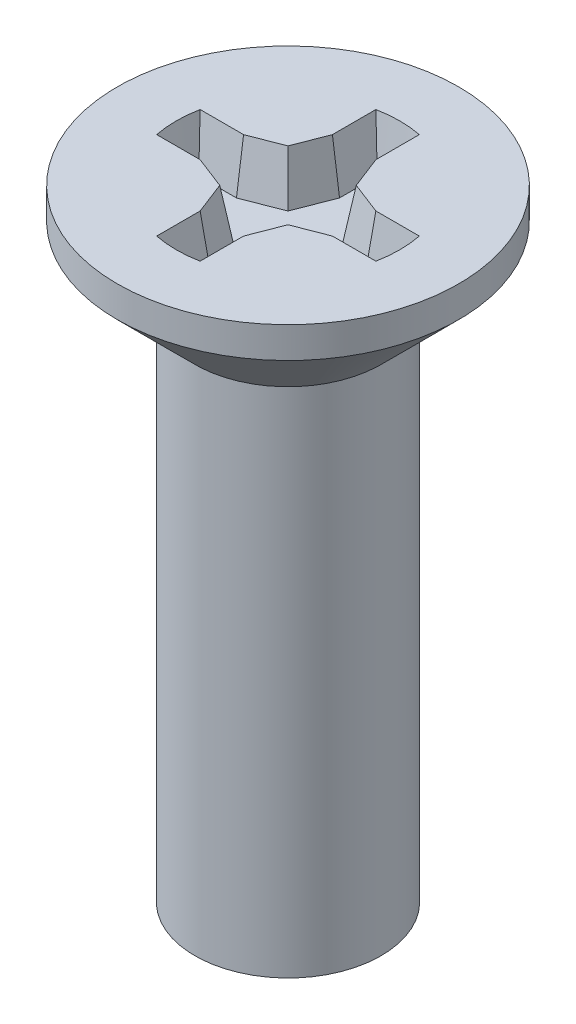
ISO-10303-21;
HEADER;
FILE_DESCRIPTION(('STEP AP214'),'2;1');
FILE_NAME('part.step','',(''),(''),'','','');
FILE_SCHEMA(('AUTOMOTIVE_DESIGN { 1 0 10303 214 1 1 1 1 }'));
ENDSEC;
DATA;
#1=APPLICATION_CONTEXT('core data for automotive mechanical design processes');
#2=APPLICATION_PROTOCOL_DEFINITION('international standard','automotive_design',2000,#1);
#3=PRODUCT_CONTEXT('',#1,'mechanical');
#4=PRODUCT('Part','Part','',(#3));
#5=PRODUCT_RELATED_PRODUCT_CATEGORY('part','',(#4));
#6=PRODUCT_DEFINITION_FORMATION('','',#4);
#7=PRODUCT_DEFINITION_CONTEXT('part definition',#1,'design');
#8=PRODUCT_DEFINITION('design','',#6,#7);
#9=PRODUCT_DEFINITION_SHAPE('','',#8);
#10=(LENGTH_UNIT() NAMED_UNIT(*) SI_UNIT(.MILLI.,.METRE.));
#11=(NAMED_UNIT(*) PLANE_ANGLE_UNIT() SI_UNIT($,.RADIAN.));
#12=(NAMED_UNIT(*) SI_UNIT($,.STERADIAN.) SOLID_ANGLE_UNIT());
#13=UNCERTAINTY_MEASURE_WITH_UNIT(LENGTH_MEASURE(1.E-05),#10,'distance_accuracy_value','');
#14=(GEOMETRIC_REPRESENTATION_CONTEXT(3) GLOBAL_UNCERTAINTY_ASSIGNED_CONTEXT((#13)) GLOBAL_UNIT_ASSIGNED_CONTEXT((#10,
#11,#12)) REPRESENTATION_CONTEXT('',''));
#15=CARTESIAN_POINT('',(0.,0.,0.));
#16=DIRECTION('',(0.,0.,1.));
#17=DIRECTION('',(1.,0.,0.));
#18=AXIS2_PLACEMENT_3D('',#15,#16,#17);
#19=CARTESIAN_POINT('',(-0.925519669670004,0.949999999999998,0.));
#20=DIRECTION('',(0.,1.,0.));
#21=DIRECTION('',(0.,0.,1.));
#22=AXIS2_PLACEMENT_3D('',#19,#20,#21);
#23=PLANE('',#22);
#24=CARTESIAN_POINT('',(0.,0.949999999988904,0.));
#25=DIRECTION('',(0.,1.,0.));
#26=DIRECTION('',(0.,0.,1.));
#27=AXIS2_PLACEMENT_3D('',#24,#25,#26);
#28=CIRCLE('',#27,1.65893841542125);
#29=CARTESIAN_POINT('',(-1.6457282293016,0.949999999994451,-0.208938415432473));
#30=VERTEX_POINT('',#29);
#31=CARTESIAN_POINT('',(-1.64572822930655,0.949999999994451,0.208938415433228));
#32=VERTEX_POINT('',#31);
#33=EDGE_CURVE('E20',#30,#32,#28,.T.);
#34=ORIENTED_EDGE('',*,*,#33,.T.);
#35=DIRECTION('',(1.,0.,0.));
#36=VECTOR('',#35,1.);
#37=CARTESIAN_POINT('',(-1.06564435830096,0.949999999999998,0.208938415433228));
#38=LINE('',#37,#36);
#39=CARTESIAN_POINT('',(-1.03924604826511,0.949999999999998,0.208938415433228));
#40=VERTEX_POINT('',#39);
#41=EDGE_CURVE('E108',#32,#40,#38,.T.);
#42=ORIENTED_EDGE('',*,*,#41,.T.);
#43=DIRECTION('',(0.932327011005493,0.,0.361616294640553));
#44=VECTOR('',#43,1.);
#45=CARTESIAN_POINT('',(-0.498989832472839,0.949999999999997,0.418484474493163));
#46=LINE('',#45,#44);
#47=CARTESIAN_POINT('',(-0.440983179903434,0.949999999999997,0.440983179903433));
#48=VERTEX_POINT('',#47);
#49=EDGE_CURVE('E119',#40,#48,#46,.T.);
#50=ORIENTED_EDGE('',*,*,#49,.T.);
#51=DIRECTION('',(0.361616294640556,0.,0.932327011005492));
#52=VECTOR('',#51,1.);
#53=CARTESIAN_POINT('',(-0.218484474493162,0.949999999999998,1.0146341907738));
#54=LINE('',#53,#52);
#55=CARTESIAN_POINT('',(-0.208938415433227,0.949999999999997,1.03924604826511));
#56=VERTEX_POINT('',#55);
#57=EDGE_CURVE('E115',#48,#56,#54,.T.);
#58=ORIENTED_EDGE('',*,*,#57,.T.);
#59=DIRECTION('',(0.,0.,1.));
#60=VECTOR('',#59,1.);
#61=CARTESIAN_POINT('',(-0.208938415433227,0.949999999999997,1.76564435830096));
#62=LINE('',#61,#60);
#63=CARTESIAN_POINT('',(-0.208938415432967,0.949999999994449,1.64572822930943));
#64=VERTEX_POINT('',#63);
#65=EDGE_CURVE('E118',#56,#64,#62,.T.);
#66=ORIENTED_EDGE('',*,*,#65,.T.);
#67=CARTESIAN_POINT('',(0.,0.949999999988902,0.));
#68=DIRECTION('',(0.,1.,0.));
#69=DIRECTION('',(0.,0.,1.));
#70=AXIS2_PLACEMENT_3D('',#67,#68,#69);
#71=CIRCLE('',#70,1.65893841542908);
#72=CARTESIAN_POINT('',(0.20893841543225,0.949999999994449,1.64572822931063));
#73=VERTEX_POINT('',#72);
#74=EDGE_CURVE('E152',#64,#73,#71,.T.);
#75=ORIENTED_EDGE('',*,*,#74,.T.);
#76=DIRECTION('',(0.,0.,1.));
#77=VECTOR('',#76,1.);
#78=CARTESIAN_POINT('',(0.208938415433228,0.949999999999997,1.06564435830096));
#79=LINE('',#78,#77);
#80=CARTESIAN_POINT('',(0.208938415433228,0.949999999999997,1.03924604826511));
#81=VERTEX_POINT('',#80);
#82=EDGE_CURVE('E153',#73,#81,#79,.F.);
#83=ORIENTED_EDGE('',*,*,#82,.T.);
#84=DIRECTION('',(0.361616294640552,0.,-0.932327011005493));
#85=VECTOR('',#84,1.);
#86=CARTESIAN_POINT('',(0.418484474493161,0.949999999999996,0.49898983247284));
#87=LINE('',#86,#85);
#88=CARTESIAN_POINT('',(0.440983179903431,0.949999999999997,0.440983179903435));
#89=VERTEX_POINT('',#88);
#90=EDGE_CURVE('E365',#81,#89,#87,.T.);
#91=ORIENTED_EDGE('',*,*,#90,.T.);
#92=DIRECTION('',(0.932327011005492,0.,-0.361616294640556));
#93=VECTOR('',#92,1.);
#94=CARTESIAN_POINT('',(1.0146341907738,0.949999999999998,0.218484474493163));
#95=LINE('',#94,#93);
#96=CARTESIAN_POINT('',(1.03924604826511,0.949999999999998,0.208938415433229));
#97=VERTEX_POINT('',#96);
#98=EDGE_CURVE('E194',#89,#97,#95,.T.);
#99=ORIENTED_EDGE('',*,*,#98,.T.);
#100=DIRECTION('',(1.,0.,0.));
#101=VECTOR('',#100,1.);
#102=CARTESIAN_POINT('',(1.76564435830096,0.949999999999998,0.208938415433228));
#103=LINE('',#102,#101);
#104=CARTESIAN_POINT('',(1.64572822930091,0.949999999994451,0.20893841543243));
#105=VERTEX_POINT('',#104);
#106=EDGE_CURVE('E195',#97,#105,#103,.T.);
#107=ORIENTED_EDGE('',*,*,#106,.T.);
#108=CARTESIAN_POINT('',(0.,0.949999999988904,0.));
#109=DIRECTION('',(0.,1.,0.));
#110=DIRECTION('',(0.,0.,1.));
#111=AXIS2_PLACEMENT_3D('',#108,#109,#110);
#112=CIRCLE('',#111,1.65893841542056);
#113=CARTESIAN_POINT('',(1.64572822930621,0.949999999994451,-0.208938415433227));
#114=VERTEX_POINT('',#113);
#115=EDGE_CURVE('E397',#105,#114,#112,.T.);
#116=ORIENTED_EDGE('',*,*,#115,.T.);
#117=DIRECTION('',(1.,0.,0.));
#118=VECTOR('',#117,1.);
#119=CARTESIAN_POINT('',(1.06564435830096,0.949999999999998,-0.208938415433227));
#120=LINE('',#119,#118);
#121=CARTESIAN_POINT('',(1.03924604826511,0.949999999999998,-0.208938415433227));
#122=VERTEX_POINT('',#121);
#123=EDGE_CURVE('E398',#114,#122,#120,.F.);
#124=ORIENTED_EDGE('',*,*,#123,.T.);
#125=DIRECTION('',(-0.932327011005493,0.,-0.361616294640553));
#126=VECTOR('',#125,1.);
#127=CARTESIAN_POINT('',(0.498989832472839,0.949999999999998,-0.418484474493161));
#128=LINE('',#127,#126);
#129=CARTESIAN_POINT('',(0.440983179903434,0.949999999999998,-0.440983179903431));
#130=VERTEX_POINT('',#129);
#131=EDGE_CURVE('E198',#122,#130,#128,.T.);
#132=ORIENTED_EDGE('',*,*,#131,.T.);
#133=DIRECTION('',(-0.361616294640555,0.,-0.932327011005492));
#134=VECTOR('',#133,1.);
#135=CARTESIAN_POINT('',(0.218484474493163,0.949999999999998,-1.0146341907738));
#136=LINE('',#135,#134);
#137=CARTESIAN_POINT('',(0.208938415433229,0.949999999999998,-1.03924604826511));
#138=VERTEX_POINT('',#137);
#139=EDGE_CURVE('E210',#130,#138,#136,.T.);
#140=ORIENTED_EDGE('',*,*,#139,.T.);
#141=DIRECTION('',(0.,0.,1.));
#142=VECTOR('',#141,1.);
#143=CARTESIAN_POINT('',(0.208938415433228,0.949999999999999,-1.76564435830096));
#144=LINE('',#143,#142);
#145=CARTESIAN_POINT('',(0.208938415433308,0.949999999994453,-1.64572822931485));
#146=VERTEX_POINT('',#145);
#147=EDGE_CURVE('E219',#138,#146,#144,.F.);
#148=ORIENTED_EDGE('',*,*,#147,.T.);
#149=CARTESIAN_POINT('',(0.,0.949999999988906,0.));
#150=DIRECTION('',(0.,1.,0.));
#151=DIRECTION('',(0.,0.,1.));
#152=AXIS2_PLACEMENT_3D('',#149,#150,#151);
#153=CIRCLE('',#152,1.6589384154345);
#154=CARTESIAN_POINT('',(-0.20893841543225,0.949999999994453,-1.64572822931335));
#155=VERTEX_POINT('',#154);
#156=EDGE_CURVE('E247',#146,#155,#153,.T.);
#157=ORIENTED_EDGE('',*,*,#156,.T.);
#158=DIRECTION('',(0.,0.,1.));
#159=VECTOR('',#158,1.);
#160=CARTESIAN_POINT('',(-0.208938415433228,0.949999999999999,-1.06564435830096));
#161=LINE('',#160,#159);
#162=CARTESIAN_POINT('',(-0.208938415433228,0.949999999999999,-1.03924604826511));
#163=VERTEX_POINT('',#162);
#164=EDGE_CURVE('E250',#155,#163,#161,.T.);
#165=ORIENTED_EDGE('',*,*,#164,.T.);
#166=DIRECTION('',(-0.361616294640553,0.,0.932327011005493));
#167=VECTOR('',#166,1.);
#168=CARTESIAN_POINT('',(-0.418484474493162,0.949999999999999,-0.498989832472838));
#169=LINE('',#168,#167);
#170=CARTESIAN_POINT('',(-0.440983179903432,0.949999999999999,-0.440983179903434));
#171=VERTEX_POINT('',#170);
#172=EDGE_CURVE('E220',#163,#171,#169,.T.);
#173=ORIENTED_EDGE('',*,*,#172,.T.);
#174=DIRECTION('',(-0.932327011005492,0.,0.361616294640555));
#175=VECTOR('',#174,1.);
#176=CARTESIAN_POINT('',(-1.0146341907738,0.949999999999998,-0.218484474493162));
#177=LINE('',#176,#175);
#178=CARTESIAN_POINT('',(-1.03924604826511,0.949999999999998,-0.208938415433228));
#179=VERTEX_POINT('',#178);
#180=EDGE_CURVE('E285',#171,#179,#177,.T.);
#181=ORIENTED_EDGE('',*,*,#180,.T.);
#182=DIRECTION('',(1.,0.,0.));
#183=VECTOR('',#182,1.);
#184=CARTESIAN_POINT('',(-1.76564435830096,0.949999999999998,-0.208938415433227));
#185=LINE('',#184,#183);
#186=EDGE_CURVE('E99',#179,#30,#185,.F.);
#187=ORIENTED_EDGE('',*,*,#186,.T.);
#188=EDGE_LOOP('',(#34,#42,#50,#58,#66,#75,#83,#91,#99,#107,#116,#124,#132,#140,#148,#157,#165,
#173,#181,#187));
#189=FACE_BOUND('',#188,.T.);
#190=ADVANCED_FACE('F17',(#189),#23,.T.);
#191=CARTESIAN_POINT('',(-0.35,1.75,1.06564435830096));
#192=DIRECTION('',(-0.918162868780907,-0.173648177666931,0.356122530577566));
#193=DIRECTION('',(0.361616294640556,0.,0.932327011005492));
#194=AXIS2_PLACEMENT_3D('',#191,#192,#193);
#195=PLANE('',#194);
#196=DIRECTION('',(0.173556561603969,-0.98428817249995,-0.0324794304278423));
#197=VECTOR('',#196,1.);
#198=CARTESIAN_POINT('',(-0.349999999999999,1.75,1.06564435830096));
#199=LINE('',#198,#197);
#200=CARTESIAN_POINT('',(-0.35,1.75,1.06564435830096));
#201=VERTEX_POINT('',#200);
#202=EDGE_CURVE('E126',#201,#56,#199,.T.);
#203=ORIENTED_EDGE('',*,*,#202,.T.);
#204=ORIENTED_EDGE('',*,*,#57,.F.);
#205=DIRECTION('',(-0.133808874519465,0.98193195802951,0.133808874519467));
#206=VECTOR('',#205,1.);
#207=CARTESIAN_POINT('',(-0.440983179903434,0.949999999999997,0.440983179903433));
#208=LINE('',#207,#206);
#209=CARTESIAN_POINT('',(-0.55,1.75,0.550000000000001));
#210=VERTEX_POINT('',#209);
#211=EDGE_CURVE('E502',#48,#210,#208,.T.);
#212=ORIENTED_EDGE('',*,*,#211,.T.);
#213=DIRECTION('',(-0.361616294640553,0.,-0.932327011005493));
#214=VECTOR('',#213,1.);
#215=CARTESIAN_POINT('',(-0.35,1.75,1.06564435830096));
#216=LINE('',#215,#214);
#217=EDGE_CURVE('E129',#201,#210,#216,.T.);
#218=ORIENTED_EDGE('',*,*,#217,.F.);
#219=EDGE_LOOP('',(#203,#204,#212,#218));
#220=FACE_BOUND('',#219,.T.);
#221=ADVANCED_FACE('F127',(#220),#195,.F.);
#222=CARTESIAN_POINT('',(-0.55,1.75,0.550000000000001));
#223=DIRECTION('',(-0.356122530577564,-0.173648177666931,0.918162868780908));
#224=DIRECTION('',(0.932327011005493,0.,0.361616294640553));
#225=AXIS2_PLACEMENT_3D('',#222,#223,#224);
#226=PLANE('',#225);
#227=ORIENTED_EDGE('',*,*,#211,.F.);
#228=ORIENTED_EDGE('',*,*,#49,.F.);
#229=DIRECTION('',(-0.0324794304278423,0.98428817249995,0.17355656160397));
#230=VECTOR('',#229,1.);
#231=CARTESIAN_POINT('',(-1.03924604826511,0.949999999999998,0.208938415433228));
#232=LINE('',#231,#230);
#233=CARTESIAN_POINT('',(-1.06564435830096,1.75,0.350000000000001));
#234=VERTEX_POINT('',#233);
#235=EDGE_CURVE('E569',#40,#234,#232,.T.);
#236=ORIENTED_EDGE('',*,*,#235,.T.);
#237=DIRECTION('',(-0.932327011005493,0.,-0.361616294640553));
#238=VECTOR('',#237,1.);
#239=CARTESIAN_POINT('',(-0.55,1.75,0.550000000000001));
#240=LINE('',#239,#238);
#241=EDGE_CURVE('E146',#210,#234,#240,.T.);
#242=ORIENTED_EDGE('',*,*,#241,.F.);
#243=EDGE_LOOP('',(#227,#228,#236,#242));
#244=FACE_BOUND('',#243,.T.);
#245=ADVANCED_FACE('F308',(#244),#226,.F.);
#246=CARTESIAN_POINT('',(-1.06564435830096,1.75,0.350000000000001));
#247=DIRECTION('',(0.,-0.173648177666931,0.984807753012208));
#248=DIRECTION('',(0.,-0.984807753012208,-0.173648177666931));
#249=AXIS2_PLACEMENT_3D('',#246,#247,#248);
#250=PLANE('',#249);
#251=ORIENTED_EDGE('',*,*,#235,.F.);
#252=ORIENTED_EDGE('',*,*,#41,.F.);
#253=CARTESIAN_POINT('',(-1.76564435830096,1.75,0.350000000000001));
#254=CARTESIAN_POINT('',(-1.70568629385699,1.33593925161647,0.276989918407646));
#255=CARTESIAN_POINT('',(-1.64572822931259,0.949999999999998,0.208938415433228));
#256=B_SPLINE_CURVE_WITH_KNOTS('',2,(#253,#254,#255),.UNSPECIFIED.,.F.,.F.,(3,3),(0.,1.),.UNSPECIFIED.);
#257=CARTESIAN_POINT('',(-1.76564435829936,1.75000000000773,0.350000000000001));
#258=VERTEX_POINT('',#257);
#259=EDGE_CURVE('E290',#32,#258,#256,.F.);
#260=ORIENTED_EDGE('',*,*,#259,.T.);
#261=DIRECTION('',(1.,0.,0.));
#262=VECTOR('',#261,1.);
#263=CARTESIAN_POINT('',(0.,1.75,0.350000000000001));
#264=LINE('',#263,#262);
#265=EDGE_CURVE('E459',#234,#258,#264,.F.);
#266=ORIENTED_EDGE('',*,*,#265,.F.);
#267=EDGE_LOOP('',(#251,#252,#260,#266));
#268=FACE_BOUND('',#267,.T.);
#269=ADVANCED_FACE('F297',(#268),#250,.F.);
#270=CARTESIAN_POINT('',(0.,1.74999999978809,0.));
#271=DIRECTION('',(0.,1.,0.));
#272=DIRECTION('',(0.,0.,1.));
#273=AXIS2_PLACEMENT_3D('',#270,#271,#272);
#274=CONICAL_SURFACE('',#273,1.79999999995677,0.17453292520447);
#275=ORIENTED_EDGE('',*,*,#259,.F.);
#276=ORIENTED_EDGE('',*,*,#33,.F.);
#277=CARTESIAN_POINT('',(-1.64572822930295,0.950000000001711,-0.208938415432003));
#278=CARTESIAN_POINT('',(-1.65070934139711,0.982062577506927,-0.214591908002511));
#279=CARTESIAN_POINT('',(-1.65566838188624,1.01412848766093,-0.220245937337858));
#280=CARTESIAN_POINT('',(-1.66559816803051,1.0786223693441,-0.231617794676689));
#281=CARTESIAN_POINT('',(-1.67056843365673,1.11105041263502,-0.237335634869037));
#282=CARTESIAN_POINT('',(-1.68052036817728,1.17626855904596,-0.248835174684639));
#283=CARTESIAN_POINT('',(-1.68550156419631,1.20905873210453,-0.2546168868549));
#284=CARTESIAN_POINT('',(-1.69547505664371,1.27500114074605,-0.266244202294425));
#285=CARTESIAN_POINT('',(-1.70046688711643,1.30815344457982,-0.272089818146893));
#286=CARTESIAN_POINT('',(-1.71046136138572,1.37482011614508,-0.283844952179579));
#287=CARTESIAN_POINT('',(-1.71546354610147,1.40833455050853,-0.289754482763727));
#288=CARTESIAN_POINT('',(-1.72547845291081,1.47572548497582,-0.301637434688358));
#289=CARTESIAN_POINT('',(-1.73049072270581,1.50960205017667,-0.307610868021888));
#290=CARTESIAN_POINT('',(-1.74052554005607,1.57771724712572,-0.319621593300561));
#291=CARTESIAN_POINT('',(-1.74554764206033,1.61195594249954,-0.325658896629195));
#292=CARTESIAN_POINT('',(-1.75560186778123,1.68079540385919,-0.337797304183237));
#293=CARTESIAN_POINT('',(-1.7606335525282,1.71539623210386,-0.343898418940028));
#294=CARTESIAN_POINT('',(-1.76564435829537,1.750000000001,-0.349999999998892));
#295=B_SPLINE_CURVE_WITH_KNOTS('',3,(#277,#278,#279,#280,#281,#282,#283,#284,#285,#286,#287,
#288,#289,#290,#291,#292,#293,#294),.UNSPECIFIED.,.F.,.F.,(4,2,2,2,2,2,2,2,4),(0.,
0.0988080919397144,0.198711901528392,0.299711495161538,0.401806930463382,0.504998256625316,
0.609285514729619,0.71466873805955,0.821147952396787),.UNSPECIFIED.);
#296=CARTESIAN_POINT('',(-1.76564435829656,1.75000000000823,-0.349999999999445));
#297=VERTEX_POINT('',#296);
#298=EDGE_CURVE('E289',#30,#297,#295,.T.);
#299=ORIENTED_EDGE('',*,*,#298,.T.);
#300=CARTESIAN_POINT('',(0.,1.75000000001546,0.));
#301=DIRECTION('',(0.,1.,0.));
#302=DIRECTION('',(0.,0.,1.));
#303=AXIS2_PLACEMENT_3D('',#300,#301,#302);
#304=CIRCLE('',#303,1.79999999999686);
#305=EDGE_CURVE('E456',#258,#297,#304,.F.);
#306=ORIENTED_EDGE('',*,*,#305,.F.);
#307=EDGE_LOOP('',(#275,#276,#299,#306));
#308=FACE_BOUND('',#307,.T.);
#309=ADVANCED_FACE('F307',(#308),#274,.F.);
#310=CARTESIAN_POINT('',(-1.76564435830096,1.75,-0.349999999999999));
#311=DIRECTION('',(0.,-0.17364817766693,-0.984807753012208));
#312=DIRECTION('',(0.,0.984807753012208,-0.17364817766693));
#313=AXIS2_PLACEMENT_3D('',#310,#311,#312);
#314=PLANE('',#313);
#315=ORIENTED_EDGE('',*,*,#298,.F.);
#316=ORIENTED_EDGE('',*,*,#186,.F.);
#317=DIRECTION('',(-0.0324794304278415,0.98428817249995,-0.173556561603967));
#318=VECTOR('',#317,1.);
#319=CARTESIAN_POINT('',(-1.03924604826511,0.949999999999998,-0.208938415433228));
#320=LINE('',#319,#318);
#321=CARTESIAN_POINT('',(-1.06564435830096,1.75,-0.349999999999999));
#322=VERTEX_POINT('',#321);
#323=EDGE_CURVE('E282',#179,#322,#320,.T.);
#324=ORIENTED_EDGE('',*,*,#323,.T.);
#325=DIRECTION('',(1.,0.,0.));
#326=VECTOR('',#325,1.);
#327=CARTESIAN_POINT('',(0.,1.75,-0.349999999999999));
#328=LINE('',#327,#326);
#329=EDGE_CURVE('E279',#297,#322,#328,.T.);
#330=ORIENTED_EDGE('',*,*,#329,.F.);
#331=EDGE_LOOP('',(#315,#316,#324,#330));
#332=FACE_BOUND('',#331,.T.);
#333=ADVANCED_FACE('F579',(#332),#314,.F.);
#334=CARTESIAN_POINT('',(-1.06564435830096,1.75,-0.349999999999999));
#335=DIRECTION('',(-0.356122530577566,-0.17364817766693,-0.918162868780907));
#336=DIRECTION('',(-0.932327011005492,0.,0.361616294640555));
#337=AXIS2_PLACEMENT_3D('',#334,#335,#336);
#338=PLANE('',#337);
#339=ORIENTED_EDGE('',*,*,#323,.F.);
#340=ORIENTED_EDGE('',*,*,#180,.F.);
#341=DIRECTION('',(-0.133808874519466,0.98193195802951,-0.133808874519463));
#342=VECTOR('',#341,1.);
#343=CARTESIAN_POINT('',(-0.440983179903432,0.949999999999998,-0.440983179903434));
#344=LINE('',#343,#342);
#345=CARTESIAN_POINT('',(-0.55,1.75,-0.549999999999999));
#346=VERTEX_POINT('',#345);
#347=EDGE_CURVE('E259',#171,#346,#344,.T.);
#348=ORIENTED_EDGE('',*,*,#347,.T.);
#349=DIRECTION('',(0.932327011005493,0.,-0.361616294640553));
#350=VECTOR('',#349,1.);
#351=CARTESIAN_POINT('',(-1.06564435830096,1.75,-0.349999999999999));
#352=LINE('',#351,#350);
#353=EDGE_CURVE('E270',#322,#346,#352,.T.);
#354=ORIENTED_EDGE('',*,*,#353,.F.);
#355=EDGE_LOOP('',(#339,#340,#348,#354));
#356=FACE_BOUND('',#355,.T.);
#357=ADVANCED_FACE('F583',(#356),#338,.F.);
#358=CARTESIAN_POINT('',(-0.549999999999999,1.75,-0.549999999999999));
#359=DIRECTION('',(-0.918162868780908,-0.17364817766693,-0.356122530577564));
#360=DIRECTION('',(-0.361616294640553,0.,0.932327011005493));
#361=AXIS2_PLACEMENT_3D('',#358,#359,#360);
#362=PLANE('',#361);
#363=ORIENTED_EDGE('',*,*,#347,.F.);
#364=ORIENTED_EDGE('',*,*,#172,.F.);
#365=DIRECTION('',(-0.173556561603969,0.98428817249995,-0.0324794304278423));
#366=VECTOR('',#365,1.);
#367=CARTESIAN_POINT('',(-0.208938415433228,0.949999999999999,-1.03924604826511));
#368=LINE('',#367,#366);
#369=CARTESIAN_POINT('',(-0.35,1.75,-1.06564435830096));
#370=VERTEX_POINT('',#369);
#371=EDGE_CURVE('E258',#163,#370,#368,.T.);
#372=ORIENTED_EDGE('',*,*,#371,.T.);
#373=DIRECTION('',(0.361616294640552,0.,-0.932327011005493));
#374=VECTOR('',#373,1.);
#375=CARTESIAN_POINT('',(-0.55,1.75,-0.549999999999999));
#376=LINE('',#375,#374);
#377=EDGE_CURVE('E266',#346,#370,#376,.T.);
#378=ORIENTED_EDGE('',*,*,#377,.F.);
#379=EDGE_LOOP('',(#363,#364,#372,#378));
#380=FACE_BOUND('',#379,.T.);
#381=ADVANCED_FACE('F239',(#380),#362,.F.);
#382=CARTESIAN_POINT('',(-0.35,1.75,-1.06564435830096));
#383=DIRECTION('',(-0.984807753012208,-0.17364817766693,0.));
#384=DIRECTION('',(0.17364817766693,-0.984807753012208,0.));
#385=AXIS2_PLACEMENT_3D('',#382,#383,#384);
#386=PLANE('',#385);
#387=ORIENTED_EDGE('',*,*,#371,.F.);
#388=ORIENTED_EDGE('',*,*,#164,.F.);
#389=CARTESIAN_POINT('',(-0.35,1.75,-1.76564435830096));
#390=CARTESIAN_POINT('',(-0.276989918408198,1.33593925161961,-1.70568629377603));
#391=CARTESIAN_POINT('',(-0.208938415433228,0.949999999999999,-1.64572822931259));
#392=B_SPLINE_CURVE_WITH_KNOTS('',2,(#389,#390,#391),.UNSPECIFIED.,.F.,.F.,(3,3),(0.,1.),.UNSPECIFIED.);
#393=CARTESIAN_POINT('',(-0.35,1.75000000000773,-1.76564435829936));
#394=VERTEX_POINT('',#393);
#395=EDGE_CURVE('E243',#155,#394,#392,.F.);
#396=ORIENTED_EDGE('',*,*,#395,.T.);
#397=DIRECTION('',(0.,0.,1.));
#398=VECTOR('',#397,1.);
#399=CARTESIAN_POINT('',(-0.35,1.75,-2.75));
#400=LINE('',#399,#398);
#401=EDGE_CURVE('E269',#370,#394,#400,.F.);
#402=ORIENTED_EDGE('',*,*,#401,.F.);
#403=EDGE_LOOP('',(#387,#388,#396,#402));
#404=FACE_BOUND('',#403,.T.);
#405=ADVANCED_FACE('F233',(#404),#386,.F.);
#406=CARTESIAN_POINT('',(0.,1.74999999978809,0.));
#407=DIRECTION('',(0.,1.,0.));
#408=DIRECTION('',(0.,0.,1.));
#409=AXIS2_PLACEMENT_3D('',#406,#407,#408);
#410=CONICAL_SURFACE('',#409,1.79999999995677,0.174532925188408);
#411=ORIENTED_EDGE('',*,*,#395,.F.);
#412=ORIENTED_EDGE('',*,*,#156,.F.);
#413=CARTESIAN_POINT('',(0.208938415433622,0.949999999999447,-1.64572822931569));
#414=CARTESIAN_POINT('',(0.214591908008663,0.982062577523689,-1.65070934141213));
#415=CARTESIAN_POINT('',(0.220245937348456,1.01412848769674,-1.6556683819035));
#416=CARTESIAN_POINT('',(0.231617794695007,1.07862236941258,-1.66559816805139));
#417=CARTESIAN_POINT('',(0.237335634890626,1.11105041271713,-1.67056843367898));
#418=CARTESIAN_POINT('',(0.248835174711541,1.17626855914992,-1.68052036820143));
#419=CARTESIAN_POINT('',(0.254616886883841,1.2090587322167,-1.685501564221));
#420=CARTESIAN_POINT('',(0.266244202326158,1.27500114086924,-1.69547505666867));
#421=CARTESIAN_POINT('',(0.272089818179377,1.30815344470581,-1.70046688714114));
#422=CARTESIAN_POINT('',(0.283844952212225,1.37482011627126,-1.71046136140915));
#423=CARTESIAN_POINT('',(0.289754482795781,1.40833455063209,-1.71546354612388));
#424=CARTESIAN_POINT('',(0.301637434717831,1.47572548508874,-1.72547845293048));
#425=CARTESIAN_POINT('',(0.307610868049367,1.50960205028156,-1.73049072272375));
#426=CARTESIAN_POINT('',(0.319621593322604,1.57771724720915,-1.74052554006987));
#427=CARTESIAN_POINT('',(0.325658896647791,1.61195594256952,-1.74554764207173));
#428=CARTESIAN_POINT('',(0.337797304193436,1.68079540389687,-1.75560186778719));
#429=CARTESIAN_POINT('',(0.343898418945271,1.71539623212268,-1.76063355253113));
#430=CARTESIAN_POINT('',(0.349999999998892,1.750000000001,-1.76564435829537));
#431=B_SPLINE_CURVE_WITH_KNOTS('',3,(#413,#414,#415,#416,#417,#418,#419,#420,#421,#422,#423,
#424,#425,#426,#427,#428,#429,#430),.UNSPECIFIED.,.F.,.F.,(4,2,2,2,2,2,2,2,4),(0.,
0.0988080919986423,0.198711901629437,0.299711495287876,0.401806930598179,0.504998256751725,
0.609285514830782,0.714668738118599,0.821147952396842),.UNSPECIFIED.);
#432=CARTESIAN_POINT('',(0.349999999999446,1.75000000000823,-1.76564435829656));
#433=VERTEX_POINT('',#432);
#434=EDGE_CURVE('E213',#146,#433,#431,.T.);
#435=ORIENTED_EDGE('',*,*,#434,.T.);
#436=CARTESIAN_POINT('',(0.,1.75000000001546,0.));
#437=DIRECTION('',(0.,1.,0.));
#438=DIRECTION('',(0.,0.,1.));
#439=AXIS2_PLACEMENT_3D('',#436,#437,#438);
#440=CIRCLE('',#439,1.79999999999686);
#441=EDGE_CURVE('E445',#394,#433,#440,.F.);
#442=ORIENTED_EDGE('',*,*,#441,.F.);
#443=EDGE_LOOP('',(#411,#412,#435,#442));
#444=FACE_BOUND('',#443,.T.);
#445=ADVANCED_FACE('F222',(#444),#410,.F.);
#446=CARTESIAN_POINT('',(0.35,1.75,-1.76564435830096));
#447=DIRECTION('',(0.984807753012208,-0.17364817766693,0.));
#448=DIRECTION('',(0.17364817766693,0.984807753012208,0.));
#449=AXIS2_PLACEMENT_3D('',#446,#447,#448);
#450=PLANE('',#449);
#451=ORIENTED_EDGE('',*,*,#434,.F.);
#452=ORIENTED_EDGE('',*,*,#147,.F.);
#453=DIRECTION('',(0.173556561603967,0.98428817249995,-0.0324794304278416));
#454=VECTOR('',#453,1.);
#455=CARTESIAN_POINT('',(0.20893841543323,0.949999999999999,-1.03924604826511));
#456=LINE('',#455,#454);
#457=CARTESIAN_POINT('',(0.35,1.75,-1.06564435830096));
#458=VERTEX_POINT('',#457);
#459=EDGE_CURVE('E207',#138,#458,#456,.T.);
#460=ORIENTED_EDGE('',*,*,#459,.T.);
#461=DIRECTION('',(0.,0.,1.));
#462=VECTOR('',#461,1.);
#463=CARTESIAN_POINT('',(0.35,1.75,-2.75));
#464=LINE('',#463,#462);
#465=EDGE_CURVE('E426',#433,#458,#464,.T.);
#466=ORIENTED_EDGE('',*,*,#465,.F.);
#467=EDGE_LOOP('',(#451,#452,#460,#466));
#468=FACE_BOUND('',#467,.T.);
#469=ADVANCED_FACE('F232',(#468),#450,.F.);
#470=CARTESIAN_POINT('',(0.35,1.75,-1.06564435830096));
#471=DIRECTION('',(0.918162868780907,-0.17364817766693,-0.356122530577566));
#472=DIRECTION('',(-0.361616294640555,0.,-0.932327011005492));
#473=AXIS2_PLACEMENT_3D('',#470,#471,#472);
#474=PLANE('',#473);
#475=ORIENTED_EDGE('',*,*,#459,.F.);
#476=ORIENTED_EDGE('',*,*,#139,.F.);
#477=DIRECTION('',(0.133808874519466,0.98193195802951,-0.133808874519465));
#478=VECTOR('',#477,1.);
#479=CARTESIAN_POINT('',(0.440983179903434,0.949999999999998,-0.440983179903431));
#480=LINE('',#479,#478);
#481=CARTESIAN_POINT('',(0.550000000000001,1.75,-0.549999999999999));
#482=VERTEX_POINT('',#481);
#483=EDGE_CURVE('E206',#130,#482,#480,.T.);
#484=ORIENTED_EDGE('',*,*,#483,.T.);
#485=DIRECTION('',(0.361616294640554,0.,0.932327011005493));
#486=VECTOR('',#485,1.);
#487=CARTESIAN_POINT('',(0.35,1.75,-1.06564435830096));
#488=LINE('',#487,#486);
#489=EDGE_CURVE('E417',#458,#482,#488,.T.);
#490=ORIENTED_EDGE('',*,*,#489,.F.);
#491=EDGE_LOOP('',(#475,#476,#484,#490));
#492=FACE_BOUND('',#491,.T.);
#493=ADVANCED_FACE('F674',(#492),#474,.F.);
#494=CARTESIAN_POINT('',(0.55,1.75,-0.549999999999998));
#495=DIRECTION('',(0.356122530577564,-0.17364817766693,-0.918162868780908));
#496=DIRECTION('',(-0.932327011005493,0.,-0.361616294640553));
#497=AXIS2_PLACEMENT_3D('',#494,#495,#496);
#498=PLANE('',#497);
#499=ORIENTED_EDGE('',*,*,#483,.F.);
#500=ORIENTED_EDGE('',*,*,#131,.F.);
#501=DIRECTION('',(0.0324794304278423,0.98428817249995,-0.173556561603969));
#502=VECTOR('',#501,1.);
#503=CARTESIAN_POINT('',(1.03924604826511,0.949999999999998,-0.208938415433227));
#504=LINE('',#503,#502);
#505=CARTESIAN_POINT('',(1.06564435830096,1.75,-0.349999999999999));
#506=VERTEX_POINT('',#505);
#507=EDGE_CURVE('E406',#122,#506,#504,.T.);
#508=ORIENTED_EDGE('',*,*,#507,.T.);
#509=DIRECTION('',(0.932327011005493,0.,0.361616294640554));
#510=VECTOR('',#509,1.);
#511=CARTESIAN_POINT('',(0.550000000000001,1.75,-0.549999999999999));
#512=LINE('',#511,#510);
#513=EDGE_CURVE('E413',#482,#506,#512,.T.);
#514=ORIENTED_EDGE('',*,*,#513,.F.);
#515=EDGE_LOOP('',(#499,#500,#508,#514));
#516=FACE_BOUND('',#515,.T.);
#517=ADVANCED_FACE('F681',(#516),#498,.F.);
#518=CARTESIAN_POINT('',(1.06564435830096,1.75,-0.349999999999999));
#519=DIRECTION('',(0.,-0.17364817766693,-0.984807753012208));
#520=DIRECTION('',(0.,0.984807753012208,-0.17364817766693));
#521=AXIS2_PLACEMENT_3D('',#518,#519,#520);
#522=PLANE('',#521);
#523=ORIENTED_EDGE('',*,*,#507,.F.);
#524=ORIENTED_EDGE('',*,*,#123,.F.);
#525=CARTESIAN_POINT('',(1.76564435830096,1.75,-0.349999999999999));
#526=CARTESIAN_POINT('',(1.70568629384462,1.33593925161649,-0.276989918407647));
#527=CARTESIAN_POINT('',(1.64572822931259,0.949999999999998,-0.208938415433227));
#528=B_SPLINE_CURVE_WITH_KNOTS('',2,(#525,#526,#527),.UNSPECIFIED.,.F.,.F.,(3,3),(0.,1.),.UNSPECIFIED.);
#529=CARTESIAN_POINT('',(1.76564435830135,1.75000000000773,-0.349999999999999));
#530=VERTEX_POINT('',#529);
#531=EDGE_CURVE('E392',#114,#530,#528,.F.);
#532=ORIENTED_EDGE('',*,*,#531,.T.);
#533=DIRECTION('',(1.,0.,0.));
#534=VECTOR('',#533,1.);
#535=CARTESIAN_POINT('',(0.,1.75,-0.349999999999999));
#536=LINE('',#535,#534);
#537=EDGE_CURVE('E416',#506,#530,#536,.T.);
#538=ORIENTED_EDGE('',*,*,#537,.F.);
#539=EDGE_LOOP('',(#523,#524,#532,#538));
#540=FACE_BOUND('',#539,.T.);
#541=ADVANCED_FACE('F185',(#540),#522,.F.);
#542=CARTESIAN_POINT('',(0.,1.74999999984493,0.));
#543=DIRECTION('',(0.,1.,0.));
#544=DIRECTION('',(0.,0.,1.));
#545=AXIS2_PLACEMENT_3D('',#542,#543,#544);
#546=CONICAL_SURFACE('',#545,1.79999999997071,0.174532925210055);
#547=ORIENTED_EDGE('',*,*,#531,.F.);
#548=ORIENTED_EDGE('',*,*,#115,.F.);
#549=CARTESIAN_POINT('',(1.64572822930228,0.95000000000183,0.20893841543192));
#550=CARTESIAN_POINT('',(1.65070934139616,0.982062577503822,0.214591908001631));
#551=CARTESIAN_POINT('',(1.655668381885,1.0141284876546,0.220245937336203));
#552=CARTESIAN_POINT('',(1.66559816802886,1.07862236933223,0.231617794673697));
#553=CARTESIAN_POINT('',(1.67056843365495,1.11105041262083,0.237335634865481));
#554=CARTESIAN_POINT('',(1.68052036817536,1.17626855902805,0.248835174680176));
#555=CARTESIAN_POINT('',(1.6855015641944,1.20905873208522,0.254616886850094));
#556=CARTESIAN_POINT('',(1.69547505664194,1.27500114072485,0.266244202289164));
#557=CARTESIAN_POINT('',(1.70046688711481,1.30815344455813,0.272089818141521));
#558=CARTESIAN_POINT('',(1.7104613613845,1.37482011612333,0.283844952174225));
#559=CARTESIAN_POINT('',(1.71546354610051,1.40833455048719,0.289754482758502));
#560=CARTESIAN_POINT('',(1.72547845291051,1.47572548495625,0.301637434683641));
#561=CARTESIAN_POINT('',(1.73049072270589,1.50960205015844,0.30761086801755));
#562=CARTESIAN_POINT('',(1.74052554005703,1.57771724711108,0.31962159329724));
#563=CARTESIAN_POINT('',(1.74554764206179,1.61195594248714,0.325658896626514));
#564=CARTESIAN_POINT('',(1.75560186778378,1.6807954038522,0.337797304182105));
#565=CARTESIAN_POINT('',(1.76063355253135,1.71539623210004,0.343898418939805));
#566=CARTESIAN_POINT('',(1.7656443582991,1.75000000000033,0.349999999999633));
#567=B_SPLINE_CURVE_WITH_KNOTS('',3,(#549,#550,#551,#552,#553,#554,#555,#556,#557,#558,#559,
#560,#561,#562,#563,#564,#565,#566),.UNSPECIFIED.,.F.,.F.,(4,2,2,2,2,2,2,2,4),(0.,
0.0988080919297607,0.198711901511326,0.2997114951402,0.401806930440619,0.504998256603973,
0.609285514712545,0.714668738049596,0.821147952396805),.UNSPECIFIED.);
#568=CARTESIAN_POINT('',(1.76564435830042,1.7500000000079,0.349999999999817));
#569=VERTEX_POINT('',#568);
#570=EDGE_CURVE('E190',#105,#569,#567,.T.);
#571=ORIENTED_EDGE('',*,*,#570,.T.);
#572=CARTESIAN_POINT('',(0.,1.75000000001546,0.));
#573=DIRECTION('',(0.,1.,0.));
#574=DIRECTION('',(0.,0.,1.));
#575=AXIS2_PLACEMENT_3D('',#572,#573,#574);
#576=CIRCLE('',#575,1.80000000000077);
#577=EDGE_CURVE('E454',#530,#569,#576,.F.);
#578=ORIENTED_EDGE('',*,*,#577,.F.);
#579=EDGE_LOOP('',(#547,#548,#571,#578));
#580=FACE_BOUND('',#579,.T.);
#581=ADVANCED_FACE('F180',(#580),#546,.F.);
#582=CARTESIAN_POINT('',(1.76564435830096,1.75,0.350000000000001));
#583=DIRECTION('',(0.,-0.173648177666931,0.984807753012208));
#584=DIRECTION('',(0.,-0.984807753012208,-0.173648177666931));
#585=AXIS2_PLACEMENT_3D('',#582,#583,#584);
#586=PLANE('',#585);
#587=ORIENTED_EDGE('',*,*,#570,.F.);
#588=ORIENTED_EDGE('',*,*,#106,.F.);
#589=DIRECTION('',(0.0324794304278415,0.98428817249995,0.173556561603968));
#590=VECTOR('',#589,1.);
#591=CARTESIAN_POINT('',(1.03924604826511,0.949999999999997,0.208938415433229));
#592=LINE('',#591,#590);
#593=CARTESIAN_POINT('',(1.06564435830096,1.75,0.350000000000001));
#594=VERTEX_POINT('',#593);
#595=EDGE_CURVE('E372',#97,#594,#592,.T.);
#596=ORIENTED_EDGE('',*,*,#595,.T.);
#597=DIRECTION('',(1.,0.,0.));
#598=VECTOR('',#597,1.);
#599=CARTESIAN_POINT('',(0.,1.75,0.350000000000001));
#600=LINE('',#599,#598);
#601=EDGE_CURVE('E384',#569,#594,#600,.F.);
#602=ORIENTED_EDGE('',*,*,#601,.F.);
#603=EDGE_LOOP('',(#587,#588,#596,#602));
#604=FACE_BOUND('',#603,.T.);
#605=ADVANCED_FACE('F176',(#604),#586,.F.);
#606=CARTESIAN_POINT('',(1.06564435830096,1.75,0.350000000000001));
#607=DIRECTION('',(0.356122530577566,-0.173648177666931,0.918162868780907));
#608=DIRECTION('',(0.932327011005492,0.,-0.361616294640556));
#609=AXIS2_PLACEMENT_3D('',#606,#607,#608);
#610=PLANE('',#609);
#611=ORIENTED_EDGE('',*,*,#595,.F.);
#612=ORIENTED_EDGE('',*,*,#98,.F.);
#613=DIRECTION('',(0.133808874519467,0.98193195802951,0.133808874519466));
#614=VECTOR('',#613,1.);
#615=CARTESIAN_POINT('',(0.440983179903431,0.949999999999998,0.440983179903435));
#616=LINE('',#615,#614);
#617=CARTESIAN_POINT('',(0.549999999999999,1.75,0.550000000000002));
#618=VERTEX_POINT('',#617);
#619=EDGE_CURVE('E362',#89,#618,#616,.T.);
#620=ORIENTED_EDGE('',*,*,#619,.T.);
#621=DIRECTION('',(-0.932327011005493,0.,0.361616294640554));
#622=VECTOR('',#621,1.);
#623=CARTESIAN_POINT('',(1.06564435830096,1.75,0.350000000000001));
#624=LINE('',#623,#622);
#625=EDGE_CURVE('E380',#594,#618,#624,.T.);
#626=ORIENTED_EDGE('',*,*,#625,.F.);
#627=EDGE_LOOP('',(#611,#612,#620,#626));
#628=FACE_BOUND('',#627,.T.);
#629=ADVANCED_FACE('F172',(#628),#610,.F.);
#630=CARTESIAN_POINT('',(0.549999999999999,1.75,0.550000000000001));
#631=DIRECTION('',(0.918162868780908,-0.173648177666931,0.356122530577563));
#632=DIRECTION('',(0.361616294640552,0.,-0.932327011005493));
#633=AXIS2_PLACEMENT_3D('',#630,#631,#632);
#634=PLANE('',#633);
#635=ORIENTED_EDGE('',*,*,#619,.F.);
#636=ORIENTED_EDGE('',*,*,#90,.F.);
#637=DIRECTION('',(0.173556561603969,0.98428817249995,0.0324794304278423));
#638=VECTOR('',#637,1.);
#639=CARTESIAN_POINT('',(0.208938415433228,0.949999999999997,1.03924604826511));
#640=LINE('',#639,#638);
#641=CARTESIAN_POINT('',(0.35,1.75,1.06564435830096));
#642=VERTEX_POINT('',#641);
#643=EDGE_CURVE('E359',#81,#642,#640,.T.);
#644=ORIENTED_EDGE('',*,*,#643,.T.);
#645=DIRECTION('',(-0.361616294640554,0.,0.932327011005493));
#646=VECTOR('',#645,1.);
#647=CARTESIAN_POINT('',(0.55,1.75,0.550000000000002));
#648=LINE('',#647,#646);
#649=EDGE_CURVE('E383',#618,#642,#648,.T.);
#650=ORIENTED_EDGE('',*,*,#649,.F.);
#651=EDGE_LOOP('',(#635,#636,#644,#650));
#652=FACE_BOUND('',#651,.T.);
#653=ADVANCED_FACE('F166',(#652),#634,.F.);
#654=CARTESIAN_POINT('',(0.35,1.75,1.06564435830096));
#655=DIRECTION('',(0.984807753012208,-0.17364817766693,0.));
#656=DIRECTION('',(0.17364817766693,0.984807753012208,0.));
#657=AXIS2_PLACEMENT_3D('',#654,#655,#656);
#658=PLANE('',#657);
#659=ORIENTED_EDGE('',*,*,#643,.F.);
#660=ORIENTED_EDGE('',*,*,#82,.F.);
#661=CARTESIAN_POINT('',(0.35,1.75,1.76564435830096));
#662=CARTESIAN_POINT('',(0.276989918408746,1.33593925162271,1.7056862937779));
#663=CARTESIAN_POINT('',(0.208938415433228,0.949999999999997,1.64572822931259));
#664=B_SPLINE_CURVE_WITH_KNOTS('',2,(#661,#662,#663),.UNSPECIFIED.,.F.,.F.,(3,3),(0.,1.),.UNSPECIFIED.);
#665=CARTESIAN_POINT('',(0.35,1.75000000000773,1.76564435830335));
#666=VERTEX_POINT('',#665);
#667=EDGE_CURVE('E132',#73,#666,#664,.F.);
#668=ORIENTED_EDGE('',*,*,#667,.T.);
#669=DIRECTION('',(0.,0.,1.));
#670=VECTOR('',#669,1.);
#671=CARTESIAN_POINT('',(0.35,1.75,-2.75));
#672=LINE('',#671,#670);
#673=EDGE_CURVE('E355',#642,#666,#672,.T.);
#674=ORIENTED_EDGE('',*,*,#673,.F.);
#675=EDGE_LOOP('',(#659,#660,#668,#674));
#676=FACE_BOUND('',#675,.T.);
#677=ADVANCED_FACE('F155',(#676),#658,.F.);
#678=CARTESIAN_POINT('',(0.,1.74999999990177,0.));
#679=DIRECTION('',(0.,1.,0.));
#680=DIRECTION('',(0.,0.,1.));
#681=AXIS2_PLACEMENT_3D('',#678,#679,#680);
#682=CONICAL_SURFACE('',#681,1.79999999998465,0.174532925204471);
#683=ORIENTED_EDGE('',*,*,#667,.F.);
#684=ORIENTED_EDGE('',*,*,#74,.F.);
#685=CARTESIAN_POINT('',(-0.20893841543296,0.950000000000371,1.64572822931049));
#686=CARTESIAN_POINT('',(-0.21459190800803,0.982062577524438,1.65070934140742));
#687=CARTESIAN_POINT('',(-0.220245937347861,1.01412848769731,1.65566838189929));
#688=CARTESIAN_POINT('',(-0.231617794694502,1.07862236941283,1.66559816804819));
#689=CARTESIAN_POINT('',(-0.237335634890174,1.11105041271722,1.67056843367629));
#690=CARTESIAN_POINT('',(-0.248835174711206,1.17626855914973,1.68052036819977));
#691=CARTESIAN_POINT('',(-0.254616886883571,1.20905873221638,1.68550156421985));
#692=CARTESIAN_POINT('',(-0.266244202326035,1.27500114086869,1.69547505666857));
#693=CARTESIAN_POINT('',(-0.272089818179336,1.30815344470515,1.70046688714156));
#694=CARTESIAN_POINT('',(-0.283844952212363,1.37482011627041,1.71046136141063));
#695=CARTESIAN_POINT('',(-0.289754482796014,1.40833455063116,1.71546354612589));
#696=CARTESIAN_POINT('',(-0.301637434718271,1.47572548508767,1.72547845293355));
#697=CARTESIAN_POINT('',(-0.307610868049918,1.50960205028043,1.73049072272736));
#698=CARTESIAN_POINT('',(-0.319621593323394,1.57771724720792,1.74052554007457));
#699=CARTESIAN_POINT('',(-0.325658896648709,1.61195594256826,1.74554764207698));
#700=CARTESIAN_POINT('',(-0.337797304194624,1.68079540389555,1.75560186779354));
#701=CARTESIAN_POINT('',(-0.343898418946602,1.71539623212136,1.76063355253803));
#702=CARTESIAN_POINT('',(-0.35000000000037,1.74999999999966,1.76564435830283));
#703=B_SPLINE_CURVE_WITH_KNOTS('',3,(#685,#686,#687,#688,#689,#690,#691,#692,#693,#694,#695,
#696,#697,#698,#699,#700,#701,#702),.UNSPECIFIED.,.F.,.F.,(4,2,2,2,2,2,2,2,4),(0.,
0.098808091998375,0.19871190162898,0.299711495287305,0.401806930597571,0.504998256751157,
0.609285514830331,0.714668738118341,0.821147952396854),.UNSPECIFIED.);
#704=CARTESIAN_POINT('',(-0.350000000000185,1.75000000000756,1.76564435830429));
#705=VERTEX_POINT('',#704);
#706=EDGE_CURVE('E35',#64,#705,#703,.T.);
#707=ORIENTED_EDGE('',*,*,#706,.T.);
#708=CARTESIAN_POINT('',(0.,1.75000000001546,0.));
#709=DIRECTION('',(0.,1.,0.));
#710=DIRECTION('',(0.,0.,1.));
#711=AXIS2_PLACEMENT_3D('',#708,#709,#710);
#712=CIRCLE('',#711,1.80000000000469);
#713=EDGE_CURVE('E350',#666,#705,#712,.F.);
#714=ORIENTED_EDGE('',*,*,#713,.F.);
#715=EDGE_LOOP('',(#683,#684,#707,#714));
#716=FACE_BOUND('',#715,.T.);
#717=ADVANCED_FACE('F165',(#716),#682,.F.);
#718=CARTESIAN_POINT('',(-0.349999999999999,1.75,1.76564435830096));
#719=DIRECTION('',(-0.984807753012208,-0.17364817766693,0.));
#720=DIRECTION('',(0.17364817766693,-0.984807753012208,0.));
#721=AXIS2_PLACEMENT_3D('',#718,#719,#720);
#722=PLANE('',#721);
#723=ORIENTED_EDGE('',*,*,#706,.F.);
#724=ORIENTED_EDGE('',*,*,#65,.F.);
#725=ORIENTED_EDGE('',*,*,#202,.F.);
#726=DIRECTION('',(0.,0.,1.));
#727=VECTOR('',#726,1.);
#728=CARTESIAN_POINT('',(-0.35,1.75,-2.75));
#729=LINE('',#728,#727);
#730=EDGE_CURVE('E525',#705,#201,#729,.F.);
#731=ORIENTED_EDGE('',*,*,#730,.F.);
#732=EDGE_LOOP('',(#723,#724,#725,#731));
#733=FACE_BOUND('',#732,.T.);
#734=ADVANCED_FACE('F134',(#733),#722,.F.);
#735=CARTESIAN_POINT('',(0.,1.75,-2.75));
#736=DIRECTION('',(0.,1.,0.));
#737=DIRECTION('',(0.,0.,1.));
#738=AXIS2_PLACEMENT_3D('',#735,#736,#737);
#739=PLANE('',#738);
#740=ORIENTED_EDGE('',*,*,#713,.T.);
#741=ORIENTED_EDGE('',*,*,#730,.T.);
#742=ORIENTED_EDGE('',*,*,#217,.T.);
#743=ORIENTED_EDGE('',*,*,#241,.T.);
#744=ORIENTED_EDGE('',*,*,#265,.T.);
#745=ORIENTED_EDGE('',*,*,#305,.T.);
#746=ORIENTED_EDGE('',*,*,#329,.T.);
#747=ORIENTED_EDGE('',*,*,#353,.T.);
#748=ORIENTED_EDGE('',*,*,#377,.T.);
#749=ORIENTED_EDGE('',*,*,#401,.T.);
#750=ORIENTED_EDGE('',*,*,#441,.T.);
#751=ORIENTED_EDGE('',*,*,#465,.T.);
#752=ORIENTED_EDGE('',*,*,#489,.T.);
#753=ORIENTED_EDGE('',*,*,#513,.T.);
#754=ORIENTED_EDGE('',*,*,#537,.T.);
#755=ORIENTED_EDGE('',*,*,#577,.T.);
#756=ORIENTED_EDGE('',*,*,#601,.T.);
#757=ORIENTED_EDGE('',*,*,#625,.T.);
#758=ORIENTED_EDGE('',*,*,#649,.T.);
#759=ORIENTED_EDGE('',*,*,#673,.T.);
#760=EDGE_LOOP('',(#740,#741,#742,#743,#744,#745,#746,#747,#748,#749,#750,#751,#752,#753,#754,
#755,#756,#757,#758,#759));
#761=FACE_BOUND('',#760,.T.);
#762=CARTESIAN_POINT('',(0.,1.75,0.));
#763=DIRECTION('',(0.,-1.,0.));
#764=DIRECTION('',(0.,0.,-1.));
#765=AXIS2_PLACEMENT_3D('',#762,#763,#764);
#766=CIRCLE('',#765,2.75);
#767=CARTESIAN_POINT('',(0.,1.75,-2.75));
#768=VERTEX_POINT('',#767);
#769=EDGE_CURVE('E527',#768,#768,#766,.T.);
#770=ORIENTED_EDGE('',*,*,#769,.F.);
#771=EDGE_LOOP('',(#770));
#772=FACE_BOUND('',#771,.T.);
#773=ADVANCED_FACE('F338',(#761,#772),#739,.T.);
#774=CARTESIAN_POINT('',(0.,1.5,0.));
#775=DIRECTION('',(0.,-1.,0.));
#776=DIRECTION('',(0.,0.,-1.));
#777=AXIS2_PLACEMENT_3D('',#774,#775,#776);
#778=CYLINDRICAL_SURFACE('',#777,2.75);
#779=CARTESIAN_POINT('',(0.,1.25000000002728,0.));
#780=DIRECTION('',(0.,1.,0.));
#781=DIRECTION('',(0.,0.,-1.));
#782=AXIS2_PLACEMENT_3D('',#779,#780,#781);
#783=CIRCLE('',#782,2.74999999999182);
#784=CARTESIAN_POINT('',(0.,1.25000000002728,-2.74999999999181));
#785=VERTEX_POINT('',#784);
#786=EDGE_CURVE('E530',#785,#785,#783,.F.);
#787=ORIENTED_EDGE('',*,*,#786,.F.);
#788=EDGE_LOOP('',(#787));
#789=FACE_BOUND('',#788,.T.);
#790=ORIENTED_EDGE('',*,*,#769,.T.);
#791=EDGE_LOOP('',(#790));
#792=FACE_BOUND('',#791,.T.);
#793=ADVANCED_FACE('F334',(#789,#792),#778,.T.);
#794=CARTESIAN_POINT('',(0.,1.24999999997044,0.));
#795=DIRECTION('',(0.,1.,0.));
#796=DIRECTION('',(0.,0.,1.));
#797=AXIS2_PLACEMENT_3D('',#794,#795,#796);
#798=CONICAL_SURFACE('',#797,2.74999999987813,0.785398163397449);
#799=CARTESIAN_POINT('',(0.,0.,0.));
#800=DIRECTION('',(0.,-1.,0.));
#801=DIRECTION('',(0.,0.,-1.));
#802=AXIS2_PLACEMENT_3D('',#799,#800,#801);
#803=CIRCLE('',#802,1.5);
#804=CARTESIAN_POINT('',(0.,0.,-1.5));
#805=VERTEX_POINT('',#804);
#806=EDGE_CURVE('E26',#805,#805,#803,.T.);
#807=ORIENTED_EDGE('',*,*,#806,.F.);
#808=EDGE_LOOP('',(#807));
#809=FACE_BOUND('',#808,.T.);
#810=ORIENTED_EDGE('',*,*,#786,.T.);
#811=EDGE_LOOP('',(#810));
#812=FACE_BOUND('',#811,.T.);
#813=ADVANCED_FACE('F327',(#809,#812),#798,.T.);
#814=CARTESIAN_POINT('',(0.,-8.25,0.));
#815=DIRECTION('',(0.,-1.,0.));
#816=DIRECTION('',(0.,0.,-1.));
#817=AXIS2_PLACEMENT_3D('',#814,#815,#816);
#818=PLANE('',#817);
#819=CARTESIAN_POINT('',(0.,-8.25,0.));
#820=DIRECTION('',(0.,-1.,0.));
#821=DIRECTION('',(0.,0.,-1.));
#822=AXIS2_PLACEMENT_3D('',#819,#820,#821);
#823=CIRCLE('',#822,1.5);
#824=CARTESIAN_POINT('',(0.,-8.25,-1.50000000000001));
#825=VERTEX_POINT('',#824);
#826=EDGE_CURVE('E11',#825,#825,#823,.F.);
#827=ORIENTED_EDGE('',*,*,#826,.F.);
#828=EDGE_LOOP('',(#827));
#829=FACE_BOUND('',#828,.T.);
#830=ADVANCED_FACE('F321',(#829),#818,.T.);
#831=CARTESIAN_POINT('',(0.,-4.125,0.));
#832=DIRECTION('',(0.,-1.,0.));
#833=DIRECTION('',(0.,0.,-1.));
#834=AXIS2_PLACEMENT_3D('',#831,#832,#833);
#835=CYLINDRICAL_SURFACE('',#834,1.5);
#836=ORIENTED_EDGE('',*,*,#826,.T.);
#837=EDGE_LOOP('',(#836));
#838=FACE_BOUND('',#837,.T.);
#839=ORIENTED_EDGE('',*,*,#806,.T.);
#840=EDGE_LOOP('',(#839));
#841=FACE_BOUND('',#840,.T.);
#842=ADVANCED_FACE('F319',(#838,#841),#835,.T.);
#843=CLOSED_SHELL('',(#190,#221,#245,#269,#309,#333,#357,#381,#405,#445,#469,#493,#517,#541,
#581,#605,#629,#653,#677,#717,#734,#773,#793,#813,#830,#842));
#844=MANIFOLD_SOLID_BREP('B1',#843);
#845=ADVANCED_BREP_SHAPE_REPRESENTATION('',(#18,#844),#14);
#846=SHAPE_DEFINITION_REPRESENTATION(#9,#845);
ENDSEC;
END-ISO-10303-21;
